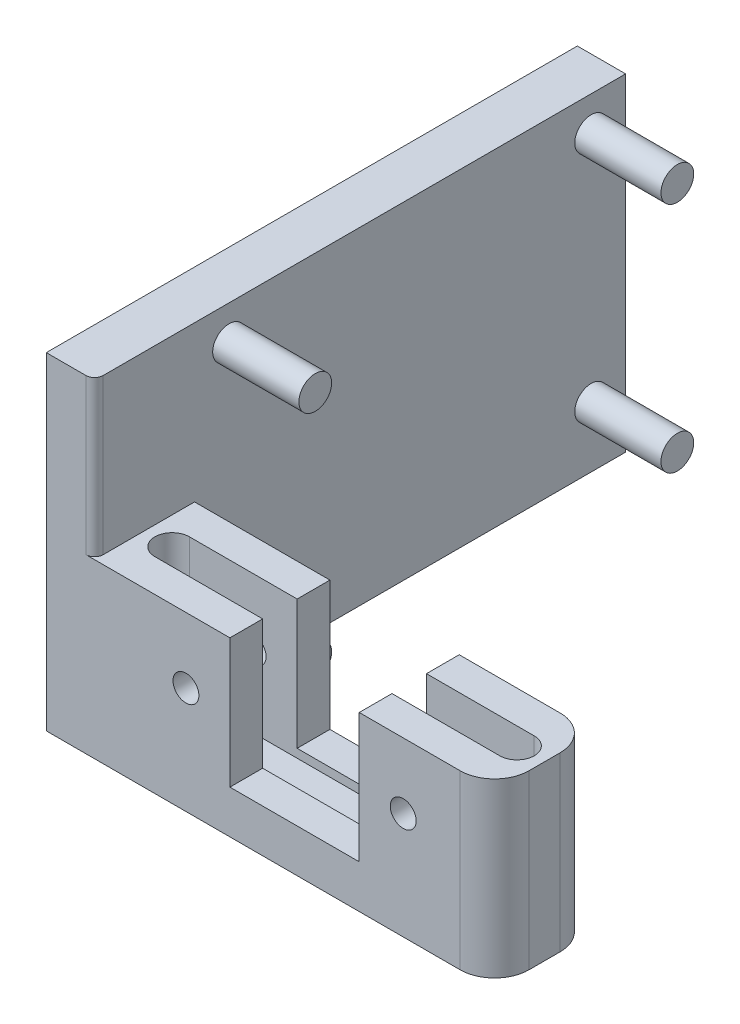
ISO-10303-21;
HEADER;
FILE_DESCRIPTION(('STEP AP214'),'2;1');
FILE_NAME('part.step','',(''),(''),'','','');
FILE_SCHEMA(('AUTOMOTIVE_DESIGN { 1 0 10303 214 1 1 1 1 }'));
ENDSEC;
DATA;
#1=APPLICATION_CONTEXT('core data for automotive mechanical design processes');
#2=APPLICATION_PROTOCOL_DEFINITION('international standard','automotive_design',2000,#1);
#3=PRODUCT_CONTEXT('',#1,'mechanical');
#4=PRODUCT('Part','Part','',(#3));
#5=PRODUCT_RELATED_PRODUCT_CATEGORY('part','',(#4));
#6=PRODUCT_DEFINITION_FORMATION('','',#4);
#7=PRODUCT_DEFINITION_CONTEXT('part definition',#1,'design');
#8=PRODUCT_DEFINITION('design','',#6,#7);
#9=PRODUCT_DEFINITION_SHAPE('','',#8);
#10=(LENGTH_UNIT() NAMED_UNIT(*) SI_UNIT(.MILLI.,.METRE.));
#11=(NAMED_UNIT(*) PLANE_ANGLE_UNIT() SI_UNIT($,.RADIAN.));
#12=(NAMED_UNIT(*) SI_UNIT($,.STERADIAN.) SOLID_ANGLE_UNIT());
#13=UNCERTAINTY_MEASURE_WITH_UNIT(LENGTH_MEASURE(1.E-05),#10,'distance_accuracy_value','');
#14=(GEOMETRIC_REPRESENTATION_CONTEXT(3) GLOBAL_UNCERTAINTY_ASSIGNED_CONTEXT((#13)) GLOBAL_UNIT_ASSIGNED_CONTEXT((#10,
#11,#12)) REPRESENTATION_CONTEXT('',''));
#15=CARTESIAN_POINT('',(0.,0.,0.));
#16=DIRECTION('',(0.,0.,1.));
#17=DIRECTION('',(1.,0.,0.));
#18=AXIS2_PLACEMENT_3D('',#15,#16,#17);
#19=CARTESIAN_POINT('',(-2.42000000000001,19.,-18.4025));
#20=DIRECTION('',(-1.,0.,0.));
#21=DIRECTION('',(0.,0.,1.));
#22=AXIS2_PLACEMENT_3D('',#19,#20,#21);
#23=PLANE('',#22);
#24=CARTESIAN_POINT('',(-2.42,3.5,4.59749999999999));
#25=DIRECTION('',(-1.,0.,0.));
#26=DIRECTION('',(0.,0.,1.));
#27=AXIS2_PLACEMENT_3D('',#24,#25,#26);
#28=CIRCLE('',#27,0.95);
#29=CARTESIAN_POINT('',(-2.42,3.5,5.54749999999999));
#30=VERTEX_POINT('',#29);
#31=EDGE_CURVE('E41',#30,#30,#28,.F.);
#32=ORIENTED_EDGE('',*,*,#31,.F.);
#33=EDGE_LOOP('',(#32));
#34=FACE_BOUND('',#33,.T.);
#35=CARTESIAN_POINT('',(-2.42000000000001,17.,-16.4025));
#36=DIRECTION('',(-1.,0.,0.));
#37=DIRECTION('',(0.,0.,1.));
#38=AXIS2_PLACEMENT_3D('',#35,#36,#37);
#39=CIRCLE('',#38,0.950000000000001);
#40=CARTESIAN_POINT('',(-2.42000000000001,17.,-15.4525));
#41=VERTEX_POINT('',#40);
#42=EDGE_CURVE('E360',#41,#41,#39,.F.);
#43=ORIENTED_EDGE('',*,*,#42,.F.);
#44=EDGE_LOOP('',(#43));
#45=FACE_BOUND('',#44,.T.);
#46=DIRECTION('',(0.,0.,-1.));
#47=VECTOR('',#46,1.);
#48=CARTESIAN_POINT('',(-2.42000000000001,19.,-18.4025));
#49=LINE('',#48,#47);
#50=CARTESIAN_POINT('',(-2.42,19.,11.8975));
#51=VERTEX_POINT('',#50);
#52=CARTESIAN_POINT('',(-2.42000000000001,19.,-18.4025));
#53=VERTEX_POINT('',#52);
#54=EDGE_CURVE('E289',#51,#53,#49,.T.);
#55=ORIENTED_EDGE('',*,*,#54,.F.);
#56=DIRECTION('',(0.,-1.,0.));
#57=VECTOR('',#56,1.);
#58=CARTESIAN_POINT('',(-2.42,19.,11.8975));
#59=LINE('',#58,#57);
#60=CARTESIAN_POINT('',(-2.42000000000001,9.99999999999999,11.8975));
#61=VERTEX_POINT('',#60);
#62=EDGE_CURVE('E352',#51,#61,#59,.T.);
#63=ORIENTED_EDGE('',*,*,#62,.T.);
#64=DIRECTION('',(0.,0.,1.));
#65=VECTOR('',#64,1.);
#66=CARTESIAN_POINT('',(-2.42000000000001,9.99999999999999,-18.4025));
#67=LINE('',#66,#65);
#68=CARTESIAN_POINT('',(-2.42000000000001,9.99999999999999,6.59749999999998));
#69=VERTEX_POINT('',#68);
#70=EDGE_CURVE('E272',#69,#61,#67,.T.);
#71=ORIENTED_EDGE('',*,*,#70,.F.);
#72=DIRECTION('',(0.,-1.,0.));
#73=VECTOR('',#72,1.);
#74=CARTESIAN_POINT('',(-2.42,19.,6.59749999999999));
#75=LINE('',#74,#73);
#76=CARTESIAN_POINT('',(-2.42,0.,6.59749999999999));
#77=VERTEX_POINT('',#76);
#78=EDGE_CURVE('E312',#69,#77,#75,.T.);
#79=ORIENTED_EDGE('',*,*,#78,.T.);
#80=DIRECTION('',(0.,0.,-1.));
#81=VECTOR('',#80,1.);
#82=CARTESIAN_POINT('',(-2.42000000000001,0.,-18.4025));
#83=LINE('',#82,#81);
#84=CARTESIAN_POINT('',(-2.42000000000001,0.,-18.4025));
#85=VERTEX_POINT('',#84);
#86=EDGE_CURVE('E304',#77,#85,#83,.T.);
#87=ORIENTED_EDGE('',*,*,#86,.T.);
#88=DIRECTION('',(0.,-1.,0.));
#89=VECTOR('',#88,1.);
#90=CARTESIAN_POINT('',(-2.42000000000001,19.,-18.4025));
#91=LINE('',#90,#89);
#92=EDGE_CURVE('E310',#53,#85,#91,.T.);
#93=ORIENTED_EDGE('',*,*,#92,.F.);
#94=EDGE_LOOP('',(#55,#63,#71,#79,#87,#93));
#95=FACE_BOUND('',#94,.T.);
#96=CARTESIAN_POINT('',(-2.42000000000001,3.5,-16.4025));
#97=DIRECTION('',(-1.,0.,0.));
#98=DIRECTION('',(0.,0.,1.));
#99=AXIS2_PLACEMENT_3D('',#96,#97,#98);
#100=CIRCLE('',#99,0.950000000000001);
#101=CARTESIAN_POINT('',(-2.42000000000001,3.5,-15.4525));
#102=VERTEX_POINT('',#101);
#103=EDGE_CURVE('E363',#102,#102,#100,.F.);
#104=ORIENTED_EDGE('',*,*,#103,.F.);
#105=EDGE_LOOP('',(#104));
#106=FACE_BOUND('',#105,.T.);
#107=CARTESIAN_POINT('',(-2.42,17.,4.59749999999999));
#108=DIRECTION('',(-1.,0.,0.));
#109=DIRECTION('',(0.,0.,1.));
#110=AXIS2_PLACEMENT_3D('',#107,#108,#109);
#111=CIRCLE('',#110,0.95);
#112=CARTESIAN_POINT('',(-2.42,17.,5.54749999999999));
#113=VERTEX_POINT('',#112);
#114=EDGE_CURVE('E11',#113,#113,#111,.F.);
#115=ORIENTED_EDGE('',*,*,#114,.F.);
#116=EDGE_LOOP('',(#115));
#117=FACE_BOUND('',#116,.T.);
#118=ADVANCED_FACE('F33',(#34,#45,#95,#106,#117),#23,.F.);
#119=CARTESIAN_POINT('',(20.78,10.,-18.4025));
#120=DIRECTION('',(0.,-1.,0.));
#121=DIRECTION('',(1.,0.,0.));
#122=AXIS2_PLACEMENT_3D('',#119,#120,#121);
#123=PLANE('',#122);
#124=DIRECTION('',(1.,0.,0.));
#125=VECTOR('',#124,1.);
#126=CARTESIAN_POINT('',(20.78,10.,12.3975));
#127=LINE('',#126,#125);
#128=CARTESIAN_POINT('',(-2.92,9.99999999999999,12.3975));
#129=VERTEX_POINT('',#128);
#130=CARTESIAN_POINT('',(5.42999999999999,9.99999999999999,12.3975));
#131=VERTEX_POINT('',#130);
#132=EDGE_CURVE('E48',#129,#131,#127,.T.);
#133=ORIENTED_EDGE('',*,*,#132,.T.);
#134=DIRECTION('',(0.,0.,1.));
#135=VECTOR('',#134,1.);
#136=CARTESIAN_POINT('',(5.42999999999999,9.99999999999999,-18.4025));
#137=LINE('',#136,#135);
#138=CARTESIAN_POINT('',(5.42999999999999,9.99999999999999,10.4975));
#139=VERTEX_POINT('',#138);
#140=EDGE_CURVE('E198',#139,#131,#137,.T.);
#141=ORIENTED_EDGE('',*,*,#140,.F.);
#142=DIRECTION('',(1.,0.,0.));
#143=VECTOR('',#142,1.);
#144=CARTESIAN_POINT('',(-0.820000000000008,9.99999999999999,10.4975));
#145=LINE('',#144,#143);
#146=CARTESIAN_POINT('',(-0.820000000000008,9.99999999999999,10.4975));
#147=VERTEX_POINT('',#146);
#148=EDGE_CURVE('E251',#147,#139,#145,.T.);
#149=ORIENTED_EDGE('',*,*,#148,.F.);
#150=CARTESIAN_POINT('',(-0.820000000000008,9.99999999999999,9.49749999999998));
#151=DIRECTION('',(0.,1.,0.));
#152=DIRECTION('',(-1.,0.,0.));
#153=AXIS2_PLACEMENT_3D('',#150,#151,#152);
#154=CIRCLE('',#153,1.);
#155=CARTESIAN_POINT('',(-0.820000000000008,9.99999999999999,8.49749999999998));
#156=VERTEX_POINT('',#155);
#157=EDGE_CURVE('E234',#156,#147,#154,.T.);
#158=ORIENTED_EDGE('',*,*,#157,.F.);
#159=DIRECTION('',(-1.,0.,0.));
#160=VECTOR('',#159,1.);
#161=CARTESIAN_POINT('',(-0.820000000000008,9.99999999999999,8.49749999999998));
#162=LINE('',#161,#160);
#163=CARTESIAN_POINT('',(5.42999999999999,9.99999999999999,8.49749999999997));
#164=VERTEX_POINT('',#163);
#165=EDGE_CURVE('E257',#164,#156,#162,.T.);
#166=ORIENTED_EDGE('',*,*,#165,.F.);
#167=CARTESIAN_POINT('',(5.42999999999999,9.99999999999999,6.59749999999998));
#168=VERTEX_POINT('',#167);
#169=EDGE_CURVE('E208',#168,#164,#137,.T.);
#170=ORIENTED_EDGE('',*,*,#169,.F.);
#171=DIRECTION('',(1.,0.,0.));
#172=VECTOR('',#171,1.);
#173=CARTESIAN_POINT('',(-2.42,9.99999999999999,6.59749999999999));
#174=LINE('',#173,#172);
#175=EDGE_CURVE('E279',#69,#168,#174,.T.);
#176=ORIENTED_EDGE('',*,*,#175,.F.);
#177=ORIENTED_EDGE('',*,*,#70,.T.);
#178=CARTESIAN_POINT('',(-2.92,9.99999999999999,11.8975));
#179=DIRECTION('',(0.,-1.,0.));
#180=DIRECTION('',(1.,0.,0.));
#181=AXIS2_PLACEMENT_3D('',#178,#179,#180);
#182=CIRCLE('',#181,0.5);
#183=EDGE_CURVE('E358',#61,#129,#182,.T.);
#184=ORIENTED_EDGE('',*,*,#183,.T.);
#185=EDGE_LOOP('',(#133,#141,#149,#158,#166,#170,#176,#177,#184));
#186=FACE_BOUND('',#185,.T.);
#187=ADVANCED_FACE('F372',(#186),#123,.F.);
#188=CARTESIAN_POINT('',(-5.22000000000001,19.,12.3975));
#189=DIRECTION('',(1.,0.,0.));
#190=DIRECTION('',(0.,0.,-1.));
#191=AXIS2_PLACEMENT_3D('',#188,#189,#190);
#192=PLANE('',#191);
#193=DIRECTION('',(0.,0.,1.));
#194=VECTOR('',#193,1.);
#195=CARTESIAN_POINT('',(-5.22000000000001,0.,12.3975));
#196=LINE('',#195,#194);
#197=CARTESIAN_POINT('',(-5.22000000000001,0.,-18.4025));
#198=VERTEX_POINT('',#197);
#199=CARTESIAN_POINT('',(-5.22000000000001,0.,12.3975));
#200=VERTEX_POINT('',#199);
#201=EDGE_CURVE('E282',#198,#200,#196,.T.);
#202=ORIENTED_EDGE('',*,*,#201,.T.);
#203=DIRECTION('',(0.,-1.,0.));
#204=VECTOR('',#203,1.);
#205=CARTESIAN_POINT('',(-5.22000000000001,19.,12.3975));
#206=LINE('',#205,#204);
#207=CARTESIAN_POINT('',(-5.22000000000001,19.,12.3975));
#208=VERTEX_POINT('',#207);
#209=EDGE_CURVE('E315',#208,#200,#206,.T.);
#210=ORIENTED_EDGE('',*,*,#209,.F.);
#211=DIRECTION('',(0.,0.,1.));
#212=VECTOR('',#211,1.);
#213=CARTESIAN_POINT('',(-5.22000000000001,19.,12.3975));
#214=LINE('',#213,#212);
#215=CARTESIAN_POINT('',(-5.22000000000001,19.,-18.4025));
#216=VERTEX_POINT('',#215);
#217=EDGE_CURVE('E283',#216,#208,#214,.T.);
#218=ORIENTED_EDGE('',*,*,#217,.F.);
#219=DIRECTION('',(0.,-1.,0.));
#220=VECTOR('',#219,1.);
#221=CARTESIAN_POINT('',(-5.22000000000001,19.,-18.4025));
#222=LINE('',#221,#220);
#223=EDGE_CURVE('E293',#216,#198,#222,.T.);
#224=ORIENTED_EDGE('',*,*,#223,.T.);
#225=EDGE_LOOP('',(#202,#210,#218,#224));
#226=FACE_BOUND('',#225,.T.);
#227=ADVANCED_FACE('F489',(#226),#192,.F.);
#228=CARTESIAN_POINT('',(20.78,19.,12.3975));
#229=DIRECTION('',(0.,0.,-1.));
#230=DIRECTION('',(-1.,0.,0.));
#231=AXIS2_PLACEMENT_3D('',#228,#229,#230);
#232=PLANE('',#231);
#233=CARTESIAN_POINT('',(15.48,6.2,12.3975));
#234=DIRECTION('',(0.,0.,1.));
#235=DIRECTION('',(1.,0.,0.));
#236=AXIS2_PLACEMENT_3D('',#233,#234,#235);
#237=CIRCLE('',#236,0.750000000000002);
#238=CARTESIAN_POINT('',(16.23,6.2,12.3975));
#239=VERTEX_POINT('',#238);
#240=EDGE_CURVE('E334',#239,#239,#237,.T.);
#241=ORIENTED_EDGE('',*,*,#240,.F.);
#242=EDGE_LOOP('',(#241));
#243=FACE_BOUND('',#242,.T.);
#244=CARTESIAN_POINT('',(2.87999999999999,6.2,12.3975));
#245=DIRECTION('',(0.,0.,1.));
#246=DIRECTION('',(1.,0.,0.));
#247=AXIS2_PLACEMENT_3D('',#244,#245,#246);
#248=CIRCLE('',#247,0.75);
#249=CARTESIAN_POINT('',(3.62999999999999,6.2,12.3975));
#250=VERTEX_POINT('',#249);
#251=EDGE_CURVE('E329',#250,#250,#248,.T.);
#252=ORIENTED_EDGE('',*,*,#251,.F.);
#253=EDGE_LOOP('',(#252));
#254=FACE_BOUND('',#253,.T.);
#255=ORIENTED_EDGE('',*,*,#132,.F.);
#256=DIRECTION('',(0.,-1.,0.));
#257=VECTOR('',#256,1.);
#258=CARTESIAN_POINT('',(-2.92,19.,12.3975));
#259=LINE('',#258,#257);
#260=CARTESIAN_POINT('',(-2.92,19.,12.3975));
#261=VERTEX_POINT('',#260);
#262=EDGE_CURVE('E53',#129,#261,#259,.F.);
#263=ORIENTED_EDGE('',*,*,#262,.T.);
#264=DIRECTION('',(1.,0.,0.));
#265=VECTOR('',#264,1.);
#266=CARTESIAN_POINT('',(20.78,19.,12.3975));
#267=LINE('',#266,#265);
#268=EDGE_CURVE('E286',#208,#261,#267,.T.);
#269=ORIENTED_EDGE('',*,*,#268,.F.);
#270=ORIENTED_EDGE('',*,*,#209,.T.);
#271=DIRECTION('',(1.,0.,0.));
#272=VECTOR('',#271,1.);
#273=CARTESIAN_POINT('',(20.78,0.,12.3975));
#274=LINE('',#273,#272);
#275=CARTESIAN_POINT('',(18.78,0.,12.3975));
#276=VERTEX_POINT('',#275);
#277=EDGE_CURVE('E296',#200,#276,#274,.T.);
#278=ORIENTED_EDGE('',*,*,#277,.T.);
#279=DIRECTION('',(0.,-1.,0.));
#280=VECTOR('',#279,1.);
#281=CARTESIAN_POINT('',(18.78,19.,12.3975));
#282=LINE('',#281,#280);
#283=CARTESIAN_POINT('',(18.78,10.,12.3975));
#284=VERTEX_POINT('',#283);
#285=EDGE_CURVE('E343',#276,#284,#282,.F.);
#286=ORIENTED_EDGE('',*,*,#285,.T.);
#287=CARTESIAN_POINT('',(12.93,9.99999999999999,12.3975));
#288=VERTEX_POINT('',#287);
#289=EDGE_CURVE('E263',#288,#284,#127,.T.);
#290=ORIENTED_EDGE('',*,*,#289,.F.);
#291=DIRECTION('',(0.,1.,0.));
#292=VECTOR('',#291,1.);
#293=CARTESIAN_POINT('',(12.93,2.5,12.3975));
#294=LINE('',#293,#292);
#295=CARTESIAN_POINT('',(12.93,2.5,12.3975));
#296=VERTEX_POINT('',#295);
#297=EDGE_CURVE('E193',#296,#288,#294,.T.);
#298=ORIENTED_EDGE('',*,*,#297,.F.);
#299=DIRECTION('',(1.,0.,0.));
#300=VECTOR('',#299,1.);
#301=CARTESIAN_POINT('',(12.93,2.5,12.3975));
#302=LINE('',#301,#300);
#303=CARTESIAN_POINT('',(5.42999999999999,2.5,12.3975));
#304=VERTEX_POINT('',#303);
#305=EDGE_CURVE('E186',#304,#296,#302,.T.);
#306=ORIENTED_EDGE('',*,*,#305,.F.);
#307=DIRECTION('',(0.,-1.,0.));
#308=VECTOR('',#307,1.);
#309=CARTESIAN_POINT('',(5.42999999999999,2.5,12.3975));
#310=LINE('',#309,#308);
#311=EDGE_CURVE('E195',#131,#304,#310,.T.);
#312=ORIENTED_EDGE('',*,*,#311,.F.);
#313=EDGE_LOOP('',(#255,#263,#269,#270,#278,#286,#290,#298,#306,#312));
#314=FACE_BOUND('',#313,.T.);
#315=ADVANCED_FACE('F201',(#243,#254,#314),#232,.F.);
#316=CARTESIAN_POINT('',(20.78,19.,6.59749999999999));
#317=DIRECTION('',(-1.,0.,0.));
#318=DIRECTION('',(0.,0.,1.));
#319=AXIS2_PLACEMENT_3D('',#316,#317,#318);
#320=PLANE('',#319);
#321=DIRECTION('',(0.,0.,1.));
#322=VECTOR('',#321,1.);
#323=CARTESIAN_POINT('',(20.78,10.,-18.4025));
#324=LINE('',#323,#322);
#325=CARTESIAN_POINT('',(20.78,10.,8.59749999999998));
#326=VERTEX_POINT('',#325);
#327=CARTESIAN_POINT('',(20.78,10.,10.3975));
#328=VERTEX_POINT('',#327);
#329=EDGE_CURVE('E273',#326,#328,#324,.T.);
#330=ORIENTED_EDGE('',*,*,#329,.T.);
#331=DIRECTION('',(0.,-1.,0.));
#332=VECTOR('',#331,1.);
#333=CARTESIAN_POINT('',(20.78,19.,10.3975));
#334=LINE('',#333,#332);
#335=CARTESIAN_POINT('',(20.78,0.,10.3975));
#336=VERTEX_POINT('',#335);
#337=EDGE_CURVE('E336',#328,#336,#334,.T.);
#338=ORIENTED_EDGE('',*,*,#337,.T.);
#339=DIRECTION('',(0.,0.,-1.));
#340=VECTOR('',#339,1.);
#341=CARTESIAN_POINT('',(20.78,0.,6.59749999999999));
#342=LINE('',#341,#340);
#343=CARTESIAN_POINT('',(20.78,0.,8.59749999999999));
#344=VERTEX_POINT('',#343);
#345=EDGE_CURVE('E299',#336,#344,#342,.T.);
#346=ORIENTED_EDGE('',*,*,#345,.T.);
#347=DIRECTION('',(0.,-1.,0.));
#348=VECTOR('',#347,1.);
#349=CARTESIAN_POINT('',(20.78,19.,8.59749999999999));
#350=LINE('',#349,#348);
#351=EDGE_CURVE('E324',#344,#326,#350,.F.);
#352=ORIENTED_EDGE('',*,*,#351,.T.);
#353=EDGE_LOOP('',(#330,#338,#346,#352));
#354=FACE_BOUND('',#353,.T.);
#355=ADVANCED_FACE('F482',(#354),#320,.F.);
#356=CARTESIAN_POINT('',(-2.42,19.,6.59749999999999));
#357=DIRECTION('',(0.,0.,1.));
#358=DIRECTION('',(1.,0.,0.));
#359=AXIS2_PLACEMENT_3D('',#356,#357,#358);
#360=PLANE('',#359);
#361=CARTESIAN_POINT('',(15.48,6.2,6.59749999999999));
#362=DIRECTION('',(0.,0.,1.));
#363=DIRECTION('',(1.,0.,0.));
#364=AXIS2_PLACEMENT_3D('',#361,#362,#363);
#365=CIRCLE('',#364,0.750000000000002);
#366=CARTESIAN_POINT('',(16.23,6.2,6.59749999999999));
#367=VERTEX_POINT('',#366);
#368=EDGE_CURVE('E786',#367,#367,#365,.T.);
#369=ORIENTED_EDGE('',*,*,#368,.T.);
#370=EDGE_LOOP('',(#369));
#371=FACE_BOUND('',#370,.T.);
#372=CARTESIAN_POINT('',(2.87999999999999,6.2,6.59749999999999));
#373=DIRECTION('',(0.,0.,1.));
#374=DIRECTION('',(1.,0.,0.));
#375=AXIS2_PLACEMENT_3D('',#372,#373,#374);
#376=CIRCLE('',#375,0.75);
#377=CARTESIAN_POINT('',(3.62999999999999,6.2,6.59749999999999));
#378=VERTEX_POINT('',#377);
#379=EDGE_CURVE('E199',#378,#378,#376,.T.);
#380=ORIENTED_EDGE('',*,*,#379,.T.);
#381=EDGE_LOOP('',(#380));
#382=FACE_BOUND('',#381,.T.);
#383=CARTESIAN_POINT('',(12.93,9.99999999999999,6.59749999999998));
#384=VERTEX_POINT('',#383);
#385=CARTESIAN_POINT('',(18.78,10.,6.59749999999999));
#386=VERTEX_POINT('',#385);
#387=EDGE_CURVE('E276',#384,#386,#174,.T.);
#388=ORIENTED_EDGE('',*,*,#387,.T.);
#389=DIRECTION('',(0.,-1.,0.));
#390=VECTOR('',#389,1.);
#391=CARTESIAN_POINT('',(18.78,19.,6.59749999999999));
#392=LINE('',#391,#390);
#393=CARTESIAN_POINT('',(18.78,0.,6.59749999999999));
#394=VERTEX_POINT('',#393);
#395=EDGE_CURVE('E349',#386,#394,#392,.T.);
#396=ORIENTED_EDGE('',*,*,#395,.T.);
#397=DIRECTION('',(-1.,0.,0.));
#398=VECTOR('',#397,1.);
#399=CARTESIAN_POINT('',(-2.42,0.,6.59749999999999));
#400=LINE('',#399,#398);
#401=EDGE_CURVE('E302',#394,#77,#400,.T.);
#402=ORIENTED_EDGE('',*,*,#401,.T.);
#403=ORIENTED_EDGE('',*,*,#78,.F.);
#404=ORIENTED_EDGE('',*,*,#175,.T.);
#405=DIRECTION('',(0.,-1.,0.));
#406=VECTOR('',#405,1.);
#407=CARTESIAN_POINT('',(5.42999999999999,19.,6.59749999999999));
#408=LINE('',#407,#406);
#409=CARTESIAN_POINT('',(5.42999999999999,2.5,6.59749999999999));
#410=VERTEX_POINT('',#409);
#411=EDGE_CURVE('E231',#168,#410,#408,.T.);
#412=ORIENTED_EDGE('',*,*,#411,.T.);
#413=DIRECTION('',(1.,0.,0.));
#414=VECTOR('',#413,1.);
#415=CARTESIAN_POINT('',(-2.42,2.49999999999999,6.59749999999999));
#416=LINE('',#415,#414);
#417=CARTESIAN_POINT('',(12.93,2.5,6.59749999999999));
#418=VERTEX_POINT('',#417);
#419=EDGE_CURVE('E219',#410,#418,#416,.T.);
#420=ORIENTED_EDGE('',*,*,#419,.T.);
#421=DIRECTION('',(0.,1.,0.));
#422=VECTOR('',#421,1.);
#423=CARTESIAN_POINT('',(12.93,19.,6.59749999999999));
#424=LINE('',#423,#422);
#425=EDGE_CURVE('E225',#418,#384,#424,.T.);
#426=ORIENTED_EDGE('',*,*,#425,.T.);
#427=EDGE_LOOP('',(#388,#396,#402,#403,#404,#412,#420,#426));
#428=FACE_BOUND('',#427,.T.);
#429=ADVANCED_FACE('F477',(#371,#382,#428),#360,.F.);
#430=CARTESIAN_POINT('',(-5.22000000000001,19.,-18.4025));
#431=DIRECTION('',(0.,0.,1.));
#432=DIRECTION('',(1.,0.,0.));
#433=AXIS2_PLACEMENT_3D('',#430,#431,#432);
#434=PLANE('',#433);
#435=DIRECTION('',(-1.,0.,0.));
#436=VECTOR('',#435,1.);
#437=CARTESIAN_POINT('',(-5.22000000000001,0.,-18.4025));
#438=LINE('',#437,#436);
#439=EDGE_CURVE('E287',#85,#198,#438,.T.);
#440=ORIENTED_EDGE('',*,*,#439,.T.);
#441=ORIENTED_EDGE('',*,*,#223,.F.);
#442=DIRECTION('',(-1.,0.,0.));
#443=VECTOR('',#442,1.);
#444=CARTESIAN_POINT('',(-5.22000000000001,19.,-18.4025));
#445=LINE('',#444,#443);
#446=EDGE_CURVE('E291',#53,#216,#445,.T.);
#447=ORIENTED_EDGE('',*,*,#446,.F.);
#448=ORIENTED_EDGE('',*,*,#92,.T.);
#449=EDGE_LOOP('',(#440,#441,#447,#448));
#450=FACE_BOUND('',#449,.T.);
#451=ADVANCED_FACE('F471',(#450),#434,.F.);
#452=CARTESIAN_POINT('',(0.,19.,0.));
#453=DIRECTION('',(0.,-1.,0.));
#454=DIRECTION('',(0.,0.,-1.));
#455=AXIS2_PLACEMENT_3D('',#452,#453,#454);
#456=PLANE('',#455);
#457=ORIENTED_EDGE('',*,*,#268,.T.);
#458=CARTESIAN_POINT('',(-2.92,19.,11.8975));
#459=DIRECTION('',(0.,-1.,0.));
#460=DIRECTION('',(0.,0.,-1.));
#461=AXIS2_PLACEMENT_3D('',#458,#459,#460);
#462=CIRCLE('',#461,0.5);
#463=EDGE_CURVE('E356',#261,#51,#462,.F.);
#464=ORIENTED_EDGE('',*,*,#463,.T.);
#465=ORIENTED_EDGE('',*,*,#54,.T.);
#466=ORIENTED_EDGE('',*,*,#446,.T.);
#467=ORIENTED_EDGE('',*,*,#217,.T.);
#468=EDGE_LOOP('',(#457,#464,#465,#466,#467));
#469=FACE_BOUND('',#468,.T.);
#470=ADVANCED_FACE('F468',(#469),#456,.F.);
#471=CARTESIAN_POINT('',(0.,0.,0.));
#472=DIRECTION('',(0.,-1.,0.));
#473=DIRECTION('',(0.,0.,-1.));
#474=AXIS2_PLACEMENT_3D('',#471,#472,#473);
#475=PLANE('',#474);
#476=ORIENTED_EDGE('',*,*,#345,.F.);
#477=CARTESIAN_POINT('',(18.78,0.,10.3975));
#478=DIRECTION('',(0.,-1.,0.));
#479=DIRECTION('',(0.,0.,-1.));
#480=AXIS2_PLACEMENT_3D('',#477,#478,#479);
#481=CIRCLE('',#480,2.);
#482=EDGE_CURVE('E341',#336,#276,#481,.T.);
#483=ORIENTED_EDGE('',*,*,#482,.T.);
#484=ORIENTED_EDGE('',*,*,#277,.F.);
#485=ORIENTED_EDGE('',*,*,#201,.F.);
#486=ORIENTED_EDGE('',*,*,#439,.F.);
#487=ORIENTED_EDGE('',*,*,#86,.F.);
#488=ORIENTED_EDGE('',*,*,#401,.F.);
#489=CARTESIAN_POINT('',(18.78,0.,8.59749999999999));
#490=DIRECTION('',(0.,-1.,0.));
#491=DIRECTION('',(0.,0.,-1.));
#492=AXIS2_PLACEMENT_3D('',#489,#490,#491);
#493=CIRCLE('',#492,2.);
#494=EDGE_CURVE('E339',#394,#344,#493,.T.);
#495=ORIENTED_EDGE('',*,*,#494,.T.);
#496=EDGE_LOOP('',(#476,#483,#484,#485,#486,#487,#488,#495));
#497=FACE_BOUND('',#496,.T.);
#498=ADVANCED_FACE('F466',(#497),#475,.T.);
#499=ORIENTED_EDGE('',*,*,#289,.T.);
#500=CARTESIAN_POINT('',(18.78,10.,10.3975));
#501=DIRECTION('',(0.,-1.,0.));
#502=DIRECTION('',(1.,0.,0.));
#503=AXIS2_PLACEMENT_3D('',#500,#501,#502);
#504=CIRCLE('',#503,2.);
#505=EDGE_CURVE('E347',#284,#328,#504,.F.);
#506=ORIENTED_EDGE('',*,*,#505,.T.);
#507=ORIENTED_EDGE('',*,*,#329,.F.);
#508=CARTESIAN_POINT('',(18.78,10.,8.59749999999999));
#509=DIRECTION('',(0.,-1.,0.));
#510=DIRECTION('',(1.,0.,0.));
#511=AXIS2_PLACEMENT_3D('',#508,#509,#510);
#512=CIRCLE('',#511,2.);
#513=EDGE_CURVE('E345',#326,#386,#512,.F.);
#514=ORIENTED_EDGE('',*,*,#513,.T.);
#515=ORIENTED_EDGE('',*,*,#387,.F.);
#516=DIRECTION('',(0.,0.,1.));
#517=VECTOR('',#516,1.);
#518=CARTESIAN_POINT('',(12.93,9.99999999999999,-18.4025));
#519=LINE('',#518,#517);
#520=CARTESIAN_POINT('',(12.93,9.99999999999999,8.49749999999997));
#521=VERTEX_POINT('',#520);
#522=EDGE_CURVE('E209',#384,#521,#519,.T.);
#523=ORIENTED_EDGE('',*,*,#522,.T.);
#524=CARTESIAN_POINT('',(19.18,10.,8.49749999999998));
#525=VERTEX_POINT('',#524);
#526=EDGE_CURVE('E239',#525,#521,#162,.T.);
#527=ORIENTED_EDGE('',*,*,#526,.F.);
#528=CARTESIAN_POINT('',(19.18,10.,9.49749999999998));
#529=DIRECTION('',(0.,1.,0.));
#530=DIRECTION('',(-1.,0.,0.));
#531=AXIS2_PLACEMENT_3D('',#528,#529,#530);
#532=CIRCLE('',#531,1.);
#533=CARTESIAN_POINT('',(19.18,10.,10.4975));
#534=VERTEX_POINT('',#533);
#535=EDGE_CURVE('E254',#534,#525,#532,.T.);
#536=ORIENTED_EDGE('',*,*,#535,.F.);
#537=CARTESIAN_POINT('',(12.93,9.99999999999999,10.4975));
#538=VERTEX_POINT('',#537);
#539=EDGE_CURVE('E250',#538,#534,#145,.T.);
#540=ORIENTED_EDGE('',*,*,#539,.F.);
#541=EDGE_CURVE('E210',#538,#288,#519,.T.);
#542=ORIENTED_EDGE('',*,*,#541,.T.);
#543=EDGE_LOOP('',(#499,#506,#507,#514,#515,#523,#527,#536,#540,#542));
#544=FACE_BOUND('',#543,.T.);
#545=ADVANCED_FACE('F462',(#544),#123,.F.);
#546=CARTESIAN_POINT('',(-0.820000000000007,1.99999999999999,9.49749999999998));
#547=DIRECTION('',(0.,1.,0.));
#548=DIRECTION('',(-1.,0.,0.));
#549=AXIS2_PLACEMENT_3D('',#546,#547,#548);
#550=CYLINDRICAL_SURFACE('',#549,1.);
#551=ORIENTED_EDGE('',*,*,#157,.T.);
#552=DIRECTION('',(0.,1.,0.));
#553=VECTOR('',#552,1.);
#554=CARTESIAN_POINT('',(-0.820000000000007,1.99999999999999,10.4975));
#555=LINE('',#554,#553);
#556=CARTESIAN_POINT('',(-0.820000000000007,1.99999999999999,10.4975));
#557=VERTEX_POINT('',#556);
#558=EDGE_CURVE('E248',#557,#147,#555,.T.);
#559=ORIENTED_EDGE('',*,*,#558,.F.);
#560=CARTESIAN_POINT('',(-0.820000000000007,1.99999999999999,9.49749999999998));
#561=DIRECTION('',(0.,1.,0.));
#562=DIRECTION('',(-1.,0.,0.));
#563=AXIS2_PLACEMENT_3D('',#560,#561,#562);
#564=CIRCLE('',#563,1.);
#565=CARTESIAN_POINT('',(-0.820000000000007,1.99999999999999,8.49749999999998));
#566=VERTEX_POINT('',#565);
#567=EDGE_CURVE('E235',#566,#557,#564,.T.);
#568=ORIENTED_EDGE('',*,*,#567,.F.);
#569=DIRECTION('',(0.,1.,0.));
#570=VECTOR('',#569,1.);
#571=CARTESIAN_POINT('',(-0.820000000000007,1.99999999999999,8.49749999999998));
#572=LINE('',#571,#570);
#573=EDGE_CURVE('E260',#566,#156,#572,.T.);
#574=ORIENTED_EDGE('',*,*,#573,.T.);
#575=EDGE_LOOP('',(#551,#559,#568,#574));
#576=FACE_BOUND('',#575,.T.);
#577=ADVANCED_FACE('F452',(#576),#550,.F.);
#578=CARTESIAN_POINT('',(-0.820000000000007,1.99999999999999,8.49749999999998));
#579=DIRECTION('',(0.,0.,-1.));
#580=DIRECTION('',(-1.,0.,0.));
#581=AXIS2_PLACEMENT_3D('',#578,#579,#580);
#582=PLANE('',#581);
#583=CARTESIAN_POINT('',(15.48,6.2,8.49749999999998));
#584=DIRECTION('',(0.,0.,-1.));
#585=DIRECTION('',(-1.,0.,0.));
#586=AXIS2_PLACEMENT_3D('',#583,#584,#585);
#587=CIRCLE('',#586,0.750000000000002);
#588=CARTESIAN_POINT('',(14.73,6.2,8.49749999999998));
#589=VERTEX_POINT('',#588);
#590=EDGE_CURVE('E333',#589,#589,#587,.T.);
#591=ORIENTED_EDGE('',*,*,#590,.T.);
#592=EDGE_LOOP('',(#591));
#593=FACE_BOUND('',#592,.T.);
#594=CARTESIAN_POINT('',(2.87999999999999,6.2,8.49749999999998));
#595=DIRECTION('',(0.,0.,-1.));
#596=DIRECTION('',(-1.,0.,0.));
#597=AXIS2_PLACEMENT_3D('',#594,#595,#596);
#598=CIRCLE('',#597,0.75);
#599=CARTESIAN_POINT('',(2.12999999999999,6.2,8.49749999999998));
#600=VERTEX_POINT('',#599);
#601=EDGE_CURVE('E328',#600,#600,#598,.T.);
#602=ORIENTED_EDGE('',*,*,#601,.T.);
#603=EDGE_LOOP('',(#602));
#604=FACE_BOUND('',#603,.T.);
#605=DIRECTION('',(-1.,0.,0.));
#606=VECTOR('',#605,1.);
#607=CARTESIAN_POINT('',(-0.820000000000007,2.49999999999999,8.49749999999998));
#608=LINE('',#607,#606);
#609=CARTESIAN_POINT('',(12.93,2.5,8.49749999999997));
#610=VERTEX_POINT('',#609);
#611=CARTESIAN_POINT('',(5.42999999999999,2.5,8.49749999999998));
#612=VERTEX_POINT('',#611);
#613=EDGE_CURVE('E216',#610,#612,#608,.T.);
#614=ORIENTED_EDGE('',*,*,#613,.T.);
#615=DIRECTION('',(0.,1.,0.));
#616=VECTOR('',#615,1.);
#617=CARTESIAN_POINT('',(5.42999999999999,1.99999999999999,8.49749999999998));
#618=LINE('',#617,#616);
#619=EDGE_CURVE('E228',#612,#164,#618,.T.);
#620=ORIENTED_EDGE('',*,*,#619,.T.);
#621=ORIENTED_EDGE('',*,*,#165,.T.);
#622=ORIENTED_EDGE('',*,*,#573,.F.);
#623=DIRECTION('',(-1.,0.,0.));
#624=VECTOR('',#623,1.);
#625=CARTESIAN_POINT('',(-0.820000000000007,1.99999999999999,8.49749999999998));
#626=LINE('',#625,#624);
#627=CARTESIAN_POINT('',(19.18,2.,8.49749999999998));
#628=VERTEX_POINT('',#627);
#629=EDGE_CURVE('E245',#628,#566,#626,.T.);
#630=ORIENTED_EDGE('',*,*,#629,.F.);
#631=DIRECTION('',(0.,1.,0.));
#632=VECTOR('',#631,1.);
#633=CARTESIAN_POINT('',(19.18,2.,8.49749999999998));
#634=LINE('',#633,#632);
#635=EDGE_CURVE('E264',#628,#525,#634,.T.);
#636=ORIENTED_EDGE('',*,*,#635,.T.);
#637=ORIENTED_EDGE('',*,*,#526,.T.);
#638=DIRECTION('',(0.,-1.,0.));
#639=VECTOR('',#638,1.);
#640=CARTESIAN_POINT('',(12.93,1.99999999999999,8.49749999999998));
#641=LINE('',#640,#639);
#642=EDGE_CURVE('E222',#521,#610,#641,.T.);
#643=ORIENTED_EDGE('',*,*,#642,.T.);
#644=EDGE_LOOP('',(#614,#620,#621,#622,#630,#636,#637,#643));
#645=FACE_BOUND('',#644,.T.);
#646=ADVANCED_FACE('F448',(#593,#604,#645),#582,.F.);
#647=CARTESIAN_POINT('',(19.18,2.,9.49749999999998));
#648=DIRECTION('',(0.,1.,0.));
#649=DIRECTION('',(-1.,0.,0.));
#650=AXIS2_PLACEMENT_3D('',#647,#648,#649);
#651=CYLINDRICAL_SURFACE('',#650,1.);
#652=ORIENTED_EDGE('',*,*,#535,.T.);
#653=ORIENTED_EDGE('',*,*,#635,.F.);
#654=CARTESIAN_POINT('',(19.18,2.,9.49749999999998));
#655=DIRECTION('',(0.,1.,0.));
#656=DIRECTION('',(-1.,0.,0.));
#657=AXIS2_PLACEMENT_3D('',#654,#655,#656);
#658=CIRCLE('',#657,1.);
#659=CARTESIAN_POINT('',(19.18,2.,10.4975));
#660=VERTEX_POINT('',#659);
#661=EDGE_CURVE('E242',#660,#628,#658,.T.);
#662=ORIENTED_EDGE('',*,*,#661,.F.);
#663=DIRECTION('',(0.,1.,0.));
#664=VECTOR('',#663,1.);
#665=CARTESIAN_POINT('',(19.18,2.,10.4975));
#666=LINE('',#665,#664);
#667=EDGE_CURVE('E266',#660,#534,#666,.T.);
#668=ORIENTED_EDGE('',*,*,#667,.T.);
#669=EDGE_LOOP('',(#652,#653,#662,#668));
#670=FACE_BOUND('',#669,.T.);
#671=ADVANCED_FACE('F451',(#670),#651,.F.);
#672=CARTESIAN_POINT('',(-0.820000000000007,1.99999999999999,10.4975));
#673=DIRECTION('',(0.,0.,1.));
#674=DIRECTION('',(1.,0.,0.));
#675=AXIS2_PLACEMENT_3D('',#672,#673,#674);
#676=PLANE('',#675);
#677=CARTESIAN_POINT('',(15.48,6.2,10.4975));
#678=DIRECTION('',(0.,0.,1.));
#679=DIRECTION('',(1.,0.,0.));
#680=AXIS2_PLACEMENT_3D('',#677,#678,#679);
#681=CIRCLE('',#680,0.750000000000002);
#682=CARTESIAN_POINT('',(16.23,6.2,10.4975));
#683=VERTEX_POINT('',#682);
#684=EDGE_CURVE('E330',#683,#683,#681,.T.);
#685=ORIENTED_EDGE('',*,*,#684,.T.);
#686=EDGE_LOOP('',(#685));
#687=FACE_BOUND('',#686,.T.);
#688=CARTESIAN_POINT('',(2.87999999999999,6.2,10.4975));
#689=DIRECTION('',(0.,0.,1.));
#690=DIRECTION('',(1.,0.,0.));
#691=AXIS2_PLACEMENT_3D('',#688,#689,#690);
#692=CIRCLE('',#691,0.75);
#693=CARTESIAN_POINT('',(3.62999999999999,6.2,10.4975));
#694=VERTEX_POINT('',#693);
#695=EDGE_CURVE('E325',#694,#694,#692,.T.);
#696=ORIENTED_EDGE('',*,*,#695,.T.);
#697=EDGE_LOOP('',(#696));
#698=FACE_BOUND('',#697,.T.);
#699=ORIENTED_EDGE('',*,*,#148,.T.);
#700=DIRECTION('',(0.,-1.,0.));
#701=VECTOR('',#700,1.);
#702=CARTESIAN_POINT('',(5.42999999999999,1.99999999999999,10.4975));
#703=LINE('',#702,#701);
#704=CARTESIAN_POINT('',(5.42999999999999,2.5,10.4975));
#705=VERTEX_POINT('',#704);
#706=EDGE_CURVE('E322',#139,#705,#703,.T.);
#707=ORIENTED_EDGE('',*,*,#706,.T.);
#708=DIRECTION('',(1.,0.,0.));
#709=VECTOR('',#708,1.);
#710=CARTESIAN_POINT('',(-0.820000000000007,2.49999999999999,10.4975));
#711=LINE('',#710,#709);
#712=CARTESIAN_POINT('',(12.93,2.5,10.4975));
#713=VERTEX_POINT('',#712);
#714=EDGE_CURVE('E189',#705,#713,#711,.T.);
#715=ORIENTED_EDGE('',*,*,#714,.T.);
#716=DIRECTION('',(0.,1.,0.));
#717=VECTOR('',#716,1.);
#718=CARTESIAN_POINT('',(12.93,1.99999999999999,10.4975));
#719=LINE('',#718,#717);
#720=EDGE_CURVE('E319',#713,#538,#719,.T.);
#721=ORIENTED_EDGE('',*,*,#720,.T.);
#722=ORIENTED_EDGE('',*,*,#539,.T.);
#723=ORIENTED_EDGE('',*,*,#667,.F.);
#724=DIRECTION('',(1.,0.,0.));
#725=VECTOR('',#724,1.);
#726=CARTESIAN_POINT('',(-0.820000000000007,1.99999999999999,10.4975));
#727=LINE('',#726,#725);
#728=EDGE_CURVE('E238',#557,#660,#727,.T.);
#729=ORIENTED_EDGE('',*,*,#728,.F.);
#730=ORIENTED_EDGE('',*,*,#558,.T.);
#731=EDGE_LOOP('',(#699,#707,#715,#721,#722,#723,#729,#730));
#732=FACE_BOUND('',#731,.T.);
#733=ADVANCED_FACE('F446',(#687,#698,#732),#676,.F.);
#734=CARTESIAN_POINT('',(-0.820000000000007,1.99999999999999,9.49749999999998));
#735=DIRECTION('',(0.,1.,0.));
#736=DIRECTION('',(-1.,0.,0.));
#737=AXIS2_PLACEMENT_3D('',#734,#735,#736);
#738=PLANE('',#737);
#739=ORIENTED_EDGE('',*,*,#567,.T.);
#740=ORIENTED_EDGE('',*,*,#728,.T.);
#741=ORIENTED_EDGE('',*,*,#661,.T.);
#742=ORIENTED_EDGE('',*,*,#629,.T.);
#743=EDGE_LOOP('',(#739,#740,#741,#742));
#744=FACE_BOUND('',#743,.T.);
#745=ADVANCED_FACE('F443',(#744),#738,.T.);
#746=CARTESIAN_POINT('',(12.93,2.5,-18.4025));
#747=DIRECTION('',(0.,-1.,0.));
#748=DIRECTION('',(1.,0.,0.));
#749=AXIS2_PLACEMENT_3D('',#746,#747,#748);
#750=PLANE('',#749);
#751=DIRECTION('',(0.,0.,1.));
#752=VECTOR('',#751,1.);
#753=CARTESIAN_POINT('',(5.42999999999999,2.5,-18.4025));
#754=LINE('',#753,#752);
#755=EDGE_CURVE('E182',#705,#304,#754,.T.);
#756=ORIENTED_EDGE('',*,*,#755,.T.);
#757=ORIENTED_EDGE('',*,*,#305,.T.);
#758=DIRECTION('',(0.,0.,1.));
#759=VECTOR('',#758,1.);
#760=CARTESIAN_POINT('',(12.93,2.5,-18.4025));
#761=LINE('',#760,#759);
#762=EDGE_CURVE('E214',#713,#296,#761,.T.);
#763=ORIENTED_EDGE('',*,*,#762,.F.);
#764=ORIENTED_EDGE('',*,*,#714,.F.);
#765=EDGE_LOOP('',(#756,#757,#763,#764));
#766=FACE_BOUND('',#765,.T.);
#767=ADVANCED_FACE('F184',(#766),#750,.F.);
#768=CARTESIAN_POINT('',(12.93,2.5,-18.4025));
#769=DIRECTION('',(1.,0.,0.));
#770=DIRECTION('',(0.,0.,-1.));
#771=AXIS2_PLACEMENT_3D('',#768,#769,#770);
#772=PLANE('',#771);
#773=ORIENTED_EDGE('',*,*,#762,.T.);
#774=ORIENTED_EDGE('',*,*,#297,.T.);
#775=ORIENTED_EDGE('',*,*,#541,.F.);
#776=ORIENTED_EDGE('',*,*,#720,.F.);
#777=EDGE_LOOP('',(#773,#774,#775,#776));
#778=FACE_BOUND('',#777,.T.);
#779=ADVANCED_FACE('F436',(#778),#772,.F.);
#780=CARTESIAN_POINT('',(5.42999999999999,2.5,-18.4025));
#781=DIRECTION('',(-1.,0.,0.));
#782=DIRECTION('',(0.,0.,1.));
#783=AXIS2_PLACEMENT_3D('',#780,#781,#782);
#784=PLANE('',#783);
#785=ORIENTED_EDGE('',*,*,#140,.T.);
#786=ORIENTED_EDGE('',*,*,#311,.T.);
#787=ORIENTED_EDGE('',*,*,#755,.F.);
#788=ORIENTED_EDGE('',*,*,#706,.F.);
#789=EDGE_LOOP('',(#785,#786,#787,#788));
#790=FACE_BOUND('',#789,.T.);
#791=ADVANCED_FACE('F196',(#790),#784,.F.);
#792=ORIENTED_EDGE('',*,*,#169,.T.);
#793=ORIENTED_EDGE('',*,*,#619,.F.);
#794=EDGE_CURVE('E192',#410,#612,#754,.T.);
#795=ORIENTED_EDGE('',*,*,#794,.F.);
#796=ORIENTED_EDGE('',*,*,#411,.F.);
#797=EDGE_LOOP('',(#792,#793,#795,#796));
#798=FACE_BOUND('',#797,.T.);
#799=ADVANCED_FACE('F434',(#798),#784,.F.);
#800=EDGE_CURVE('E213',#418,#610,#761,.T.);
#801=ORIENTED_EDGE('',*,*,#800,.T.);
#802=ORIENTED_EDGE('',*,*,#642,.F.);
#803=ORIENTED_EDGE('',*,*,#522,.F.);
#804=ORIENTED_EDGE('',*,*,#425,.F.);
#805=EDGE_LOOP('',(#801,#802,#803,#804));
#806=FACE_BOUND('',#805,.T.);
#807=ADVANCED_FACE('F430',(#806),#772,.F.);
#808=ORIENTED_EDGE('',*,*,#794,.T.);
#809=ORIENTED_EDGE('',*,*,#613,.F.);
#810=ORIENTED_EDGE('',*,*,#800,.F.);
#811=ORIENTED_EDGE('',*,*,#419,.F.);
#812=EDGE_LOOP('',(#808,#809,#810,#811));
#813=FACE_BOUND('',#812,.T.);
#814=ADVANCED_FACE('F433',(#813),#750,.F.);
#815=CARTESIAN_POINT('',(2.87999999999999,6.2,-18.4025));
#816=DIRECTION('',(0.,0.,1.));
#817=DIRECTION('',(1.,0.,0.));
#818=AXIS2_PLACEMENT_3D('',#815,#816,#817);
#819=CYLINDRICAL_SURFACE('',#818,0.75);
#820=ORIENTED_EDGE('',*,*,#251,.T.);
#821=EDGE_LOOP('',(#820));
#822=FACE_BOUND('',#821,.T.);
#823=ORIENTED_EDGE('',*,*,#695,.F.);
#824=EDGE_LOOP('',(#823));
#825=FACE_BOUND('',#824,.T.);
#826=ADVANCED_FACE('F428',(#822,#825),#819,.F.);
#827=ORIENTED_EDGE('',*,*,#601,.F.);
#828=EDGE_LOOP('',(#827));
#829=FACE_BOUND('',#828,.T.);
#830=ORIENTED_EDGE('',*,*,#379,.F.);
#831=EDGE_LOOP('',(#830));
#832=FACE_BOUND('',#831,.T.);
#833=ADVANCED_FACE('F425',(#829,#832),#819,.F.);
#834=CARTESIAN_POINT('',(15.48,6.2,-18.4025));
#835=DIRECTION('',(0.,0.,1.));
#836=DIRECTION('',(1.,0.,0.));
#837=AXIS2_PLACEMENT_3D('',#834,#835,#836);
#838=CYLINDRICAL_SURFACE('',#837,0.750000000000002);
#839=ORIENTED_EDGE('',*,*,#240,.T.);
#840=EDGE_LOOP('',(#839));
#841=FACE_BOUND('',#840,.T.);
#842=ORIENTED_EDGE('',*,*,#684,.F.);
#843=EDGE_LOOP('',(#842));
#844=FACE_BOUND('',#843,.T.);
#845=ADVANCED_FACE('F423',(#841,#844),#838,.F.);
#846=ORIENTED_EDGE('',*,*,#590,.F.);
#847=EDGE_LOOP('',(#846));
#848=FACE_BOUND('',#847,.T.);
#849=ORIENTED_EDGE('',*,*,#368,.F.);
#850=EDGE_LOOP('',(#849));
#851=FACE_BOUND('',#850,.T.);
#852=ADVANCED_FACE('F419',(#848,#851),#838,.F.);
#853=CARTESIAN_POINT('',(18.78,19.,10.3975));
#854=DIRECTION('',(0.,-1.,0.));
#855=DIRECTION('',(0.,0.,-1.));
#856=AXIS2_PLACEMENT_3D('',#853,#854,#855);
#857=CYLINDRICAL_SURFACE('',#856,2.);
#858=ORIENTED_EDGE('',*,*,#505,.F.);
#859=ORIENTED_EDGE('',*,*,#285,.F.);
#860=ORIENTED_EDGE('',*,*,#482,.F.);
#861=ORIENTED_EDGE('',*,*,#337,.F.);
#862=EDGE_LOOP('',(#858,#859,#860,#861));
#863=FACE_BOUND('',#862,.T.);
#864=ADVANCED_FACE('F422',(#863),#857,.T.);
#865=CARTESIAN_POINT('',(18.78,19.,8.59749999999999));
#866=DIRECTION('',(0.,-1.,0.));
#867=DIRECTION('',(0.,0.,-1.));
#868=AXIS2_PLACEMENT_3D('',#865,#866,#867);
#869=CYLINDRICAL_SURFACE('',#868,2.);
#870=ORIENTED_EDGE('',*,*,#513,.F.);
#871=ORIENTED_EDGE('',*,*,#351,.F.);
#872=ORIENTED_EDGE('',*,*,#494,.F.);
#873=ORIENTED_EDGE('',*,*,#395,.F.);
#874=EDGE_LOOP('',(#870,#871,#872,#873));
#875=FACE_BOUND('',#874,.T.);
#876=ADVANCED_FACE('F495',(#875),#869,.T.);
#877=CARTESIAN_POINT('',(-2.92,19.,11.8975));
#878=DIRECTION('',(0.,-1.,0.));
#879=DIRECTION('',(0.,0.,-1.));
#880=AXIS2_PLACEMENT_3D('',#877,#878,#879);
#881=CYLINDRICAL_SURFACE('',#880,0.5);
#882=ORIENTED_EDGE('',*,*,#463,.F.);
#883=ORIENTED_EDGE('',*,*,#262,.F.);
#884=ORIENTED_EDGE('',*,*,#183,.F.);
#885=ORIENTED_EDGE('',*,*,#62,.F.);
#886=EDGE_LOOP('',(#882,#883,#884,#885));
#887=FACE_BOUND('',#886,.T.);
#888=ADVANCED_FACE('F35',(#887),#881,.T.);
#889=CARTESIAN_POINT('',(2.57999999999999,17.,-16.4025));
#890=DIRECTION('',(-1.,0.,0.));
#891=DIRECTION('',(0.,0.,1.));
#892=AXIS2_PLACEMENT_3D('',#889,#890,#891);
#893=CYLINDRICAL_SURFACE('',#892,0.950000000000001);
#894=CARTESIAN_POINT('',(2.57999999999999,17.,-16.4025));
#895=DIRECTION('',(1.,0.,0.));
#896=DIRECTION('',(0.,0.,-1.));
#897=AXIS2_PLACEMENT_3D('',#894,#895,#896);
#898=CIRCLE('',#897,0.950000000000001);
#899=CARTESIAN_POINT('',(2.57999999999999,17.,-17.3525));
#900=VERTEX_POINT('',#899);
#901=EDGE_CURVE('E777',#900,#900,#898,.T.);
#902=ORIENTED_EDGE('',*,*,#901,.F.);
#903=EDGE_LOOP('',(#902));
#904=FACE_BOUND('',#903,.T.);
#905=ORIENTED_EDGE('',*,*,#42,.T.);
#906=EDGE_LOOP('',(#905));
#907=FACE_BOUND('',#906,.T.);
#908=ADVANCED_FACE('F414',(#904,#907),#893,.T.);
#909=CARTESIAN_POINT('',(2.57999999999999,17.,-16.4025));
#910=DIRECTION('',(1.,0.,0.));
#911=DIRECTION('',(0.,0.,-1.));
#912=AXIS2_PLACEMENT_3D('',#909,#910,#911);
#913=PLANE('',#912);
#914=ORIENTED_EDGE('',*,*,#901,.T.);
#915=EDGE_LOOP('',(#914));
#916=FACE_BOUND('',#915,.T.);
#917=ADVANCED_FACE('F410',(#916),#913,.T.);
#918=CARTESIAN_POINT('',(2.57999999999999,3.5,-16.4025));
#919=DIRECTION('',(-1.,0.,0.));
#920=DIRECTION('',(0.,0.,1.));
#921=AXIS2_PLACEMENT_3D('',#918,#919,#920);
#922=CYLINDRICAL_SURFACE('',#921,0.950000000000001);
#923=CARTESIAN_POINT('',(2.57999999999999,3.5,-16.4025));
#924=DIRECTION('',(1.,0.,0.));
#925=DIRECTION('',(0.,0.,-1.));
#926=AXIS2_PLACEMENT_3D('',#923,#924,#925);
#927=CIRCLE('',#926,0.950000000000001);
#928=CARTESIAN_POINT('',(2.57999999999999,3.5,-17.3525));
#929=VERTEX_POINT('',#928);
#930=EDGE_CURVE('E780',#929,#929,#927,.T.);
#931=ORIENTED_EDGE('',*,*,#930,.F.);
#932=EDGE_LOOP('',(#931));
#933=FACE_BOUND('',#932,.T.);
#934=ORIENTED_EDGE('',*,*,#103,.T.);
#935=EDGE_LOOP('',(#934));
#936=FACE_BOUND('',#935,.T.);
#937=ADVANCED_FACE('F406',(#933,#936),#922,.T.);
#938=CARTESIAN_POINT('',(2.57999999999999,3.5,-16.4025));
#939=DIRECTION('',(1.,0.,0.));
#940=DIRECTION('',(0.,0.,-1.));
#941=AXIS2_PLACEMENT_3D('',#938,#939,#940);
#942=PLANE('',#941);
#943=ORIENTED_EDGE('',*,*,#930,.T.);
#944=EDGE_LOOP('',(#943));
#945=FACE_BOUND('',#944,.T.);
#946=ADVANCED_FACE('F402',(#945),#942,.T.);
#947=CARTESIAN_POINT('',(2.58,3.5,4.59749999999999));
#948=DIRECTION('',(-1.,0.,0.));
#949=DIRECTION('',(0.,0.,1.));
#950=AXIS2_PLACEMENT_3D('',#947,#948,#949);
#951=CYLINDRICAL_SURFACE('',#950,0.95);
#952=CARTESIAN_POINT('',(2.58,3.5,4.59749999999999));
#953=DIRECTION('',(1.,0.,0.));
#954=DIRECTION('',(0.,0.,-1.));
#955=AXIS2_PLACEMENT_3D('',#952,#953,#954);
#956=CIRCLE('',#955,0.95);
#957=CARTESIAN_POINT('',(2.58,3.5,3.64749999999999));
#958=VERTEX_POINT('',#957);
#959=EDGE_CURVE('E805',#958,#958,#956,.T.);
#960=ORIENTED_EDGE('',*,*,#959,.F.);
#961=EDGE_LOOP('',(#960));
#962=FACE_BOUND('',#961,.T.);
#963=ORIENTED_EDGE('',*,*,#31,.T.);
#964=EDGE_LOOP('',(#963));
#965=FACE_BOUND('',#964,.T.);
#966=ADVANCED_FACE('F368',(#962,#965),#951,.T.);
#967=CARTESIAN_POINT('',(2.58,3.5,4.59749999999999));
#968=DIRECTION('',(1.,0.,0.));
#969=DIRECTION('',(0.,0.,-1.));
#970=AXIS2_PLACEMENT_3D('',#967,#968,#969);
#971=PLANE('',#970);
#972=ORIENTED_EDGE('',*,*,#959,.T.);
#973=EDGE_LOOP('',(#972));
#974=FACE_BOUND('',#973,.T.);
#975=ADVANCED_FACE('F387',(#974),#971,.T.);
#976=CARTESIAN_POINT('',(2.58,17.,4.59749999999999));
#977=DIRECTION('',(-1.,0.,0.));
#978=DIRECTION('',(0.,0.,1.));
#979=AXIS2_PLACEMENT_3D('',#976,#977,#978);
#980=CYLINDRICAL_SURFACE('',#979,0.95);
#981=CARTESIAN_POINT('',(2.58,17.,4.59749999999999));
#982=DIRECTION('',(1.,0.,0.));
#983=DIRECTION('',(0.,0.,-1.));
#984=AXIS2_PLACEMENT_3D('',#981,#982,#983);
#985=CIRCLE('',#984,0.95);
#986=CARTESIAN_POINT('',(2.58,17.,3.64749999999999));
#987=VERTEX_POINT('',#986);
#988=EDGE_CURVE('E808',#987,#987,#985,.T.);
#989=ORIENTED_EDGE('',*,*,#988,.F.);
#990=EDGE_LOOP('',(#989));
#991=FACE_BOUND('',#990,.T.);
#992=ORIENTED_EDGE('',*,*,#114,.T.);
#993=EDGE_LOOP('',(#992));
#994=FACE_BOUND('',#993,.T.);
#995=ADVANCED_FACE('F384',(#991,#994),#980,.T.);
#996=CARTESIAN_POINT('',(2.58,17.,4.59749999999999));
#997=DIRECTION('',(1.,0.,0.));
#998=DIRECTION('',(0.,0.,-1.));
#999=AXIS2_PLACEMENT_3D('',#996,#997,#998);
#1000=PLANE('',#999);
#1001=ORIENTED_EDGE('',*,*,#988,.T.);
#1002=EDGE_LOOP('',(#1001));
#1003=FACE_BOUND('',#1002,.T.);
#1004=ADVANCED_FACE('F386',(#1003),#1000,.T.);
#1005=CLOSED_SHELL('',(#118,#187,#227,#315,#355,#429,#451,#470,#498,#545,#577,#646,#671,#733,
#745,#767,#779,#791,#799,#807,#814,#826,#833,#845,#852,#864,#876,#888,#908,#917,#937,#946,#966,
#975,#995,#1004));
#1006=MANIFOLD_SOLID_BREP('B2',#1005);
#1007=ADVANCED_BREP_SHAPE_REPRESENTATION('',(#18,#1006),#14);
#1008=SHAPE_DEFINITION_REPRESENTATION(#9,#1007);
ENDSEC;
END-ISO-10303-21;
